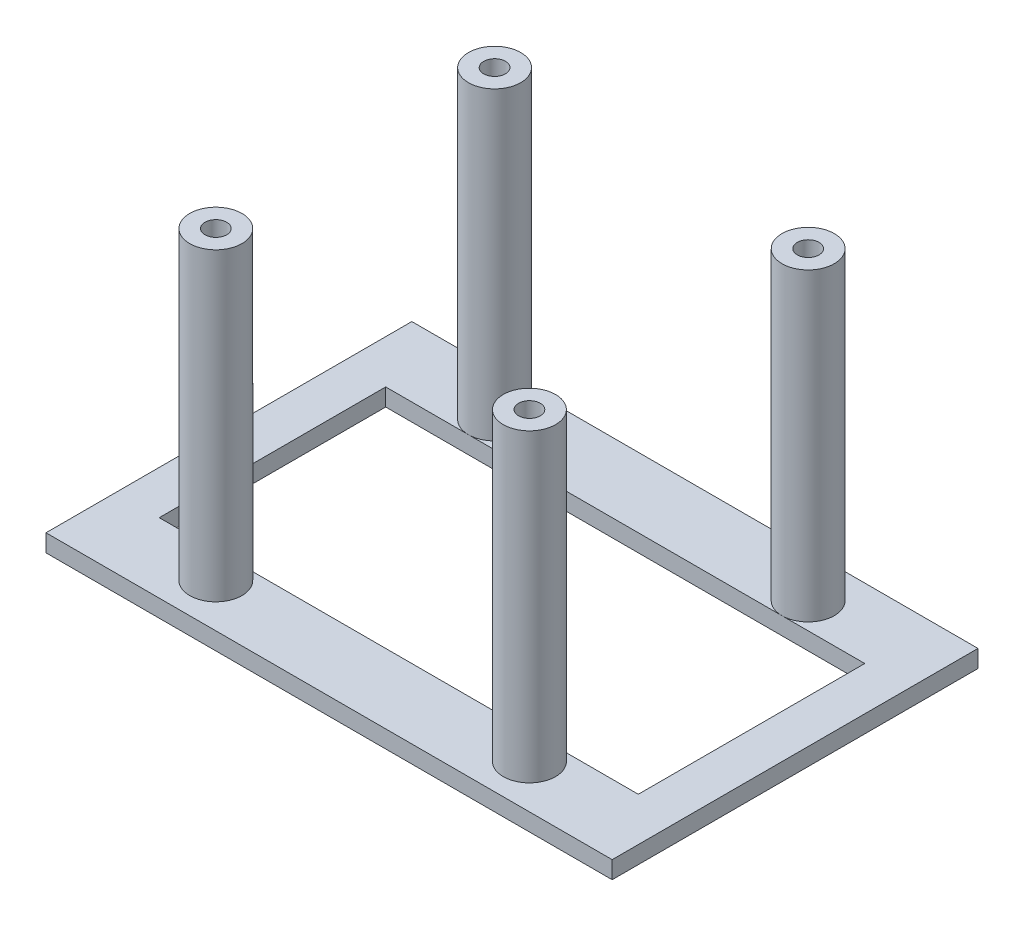
ISO-10303-21;
HEADER;
FILE_DESCRIPTION(('STEP AP214'),'2;1');
FILE_NAME('part.step','',(''),(''),'','','');
FILE_SCHEMA(('AUTOMOTIVE_DESIGN { 1 0 10303 214 1 1 1 1 }'));
ENDSEC;
DATA;
#1=APPLICATION_CONTEXT('core data for automotive mechanical design processes');
#2=APPLICATION_PROTOCOL_DEFINITION('international standard','automotive_design',2000,#1);
#3=PRODUCT_CONTEXT('',#1,'mechanical');
#4=PRODUCT('Part','Part','',(#3));
#5=PRODUCT_RELATED_PRODUCT_CATEGORY('part','',(#4));
#6=PRODUCT_DEFINITION_FORMATION('','',#4);
#7=PRODUCT_DEFINITION_CONTEXT('part definition',#1,'design');
#8=PRODUCT_DEFINITION('design','',#6,#7);
#9=PRODUCT_DEFINITION_SHAPE('','',#8);
#10=(LENGTH_UNIT() NAMED_UNIT(*) SI_UNIT(.MILLI.,.METRE.));
#11=(NAMED_UNIT(*) PLANE_ANGLE_UNIT() SI_UNIT($,.RADIAN.));
#12=(NAMED_UNIT(*) SI_UNIT($,.STERADIAN.) SOLID_ANGLE_UNIT());
#13=UNCERTAINTY_MEASURE_WITH_UNIT(LENGTH_MEASURE(1.E-05),#10,'distance_accuracy_value','');
#14=(GEOMETRIC_REPRESENTATION_CONTEXT(3) GLOBAL_UNCERTAINTY_ASSIGNED_CONTEXT((#13)) GLOBAL_UNIT_ASSIGNED_CONTEXT((#10,
#11,#12)) REPRESENTATION_CONTEXT('',''));
#15=CARTESIAN_POINT('',(0.,0.,0.));
#16=DIRECTION('',(0.,0.,1.));
#17=DIRECTION('',(1.,0.,0.));
#18=AXIS2_PLACEMENT_3D('',#15,#16,#17);
#19=CARTESIAN_POINT('',(0.,-2.,21.));
#20=DIRECTION('',(0.,0.,1.));
#21=DIRECTION('',(1.,0.,0.));
#22=AXIS2_PLACEMENT_3D('',#19,#20,#21);
#23=PLANE('',#22);
#24=DIRECTION('',(1.,0.,0.));
#25=VECTOR('',#24,1.);
#26=CARTESIAN_POINT('',(0.,0.,21.));
#27=LINE('',#26,#25);
#28=CARTESIAN_POINT('',(-32.5,0.,21.));
#29=VERTEX_POINT('',#28);
#30=CARTESIAN_POINT('',(32.5,0.,21.));
#31=VERTEX_POINT('',#30);
#32=EDGE_CURVE('E161',#29,#31,#27,.T.);
#33=ORIENTED_EDGE('',*,*,#32,.F.);
#34=DIRECTION('',(0.,1.,0.));
#35=VECTOR('',#34,1.);
#36=CARTESIAN_POINT('',(-32.5,-2.,21.));
#37=LINE('',#36,#35);
#38=CARTESIAN_POINT('',(-32.5,-2.,21.));
#39=VERTEX_POINT('',#38);
#40=EDGE_CURVE('E12',#39,#29,#37,.T.);
#41=ORIENTED_EDGE('',*,*,#40,.F.);
#42=DIRECTION('',(1.,0.,0.));
#43=VECTOR('',#42,1.);
#44=CARTESIAN_POINT('',(0.,-2.,21.));
#45=LINE('',#44,#43);
#46=CARTESIAN_POINT('',(32.5,-2.,21.));
#47=VERTEX_POINT('',#46);
#48=EDGE_CURVE('E250',#39,#47,#45,.T.);
#49=ORIENTED_EDGE('',*,*,#48,.T.);
#50=DIRECTION('',(0.,1.,0.));
#51=VECTOR('',#50,1.);
#52=CARTESIAN_POINT('',(32.5,-2.,21.));
#53=LINE('',#52,#51);
#54=EDGE_CURVE('E184',#47,#31,#53,.T.);
#55=ORIENTED_EDGE('',*,*,#54,.T.);
#56=EDGE_LOOP('',(#33,#41,#49,#55));
#57=FACE_BOUND('',#56,.T.);
#58=ADVANCED_FACE('F54',(#57),#23,.T.);
#59=CARTESIAN_POINT('',(-32.5,-2.,0.));
#60=DIRECTION('',(1.,0.,0.));
#61=DIRECTION('',(0.,0.,-1.));
#62=AXIS2_PLACEMENT_3D('',#59,#60,#61);
#63=PLANE('',#62);
#64=DIRECTION('',(0.,0.,-1.));
#65=VECTOR('',#64,1.);
#66=CARTESIAN_POINT('',(-32.5,0.,0.));
#67=LINE('',#66,#65);
#68=CARTESIAN_POINT('',(-32.5,0.,-21.));
#69=VERTEX_POINT('',#68);
#70=EDGE_CURVE('E173',#29,#69,#67,.T.);
#71=ORIENTED_EDGE('',*,*,#70,.T.);
#72=DIRECTION('',(0.,1.,0.));
#73=VECTOR('',#72,1.);
#74=CARTESIAN_POINT('',(-32.5,-2.,-21.));
#75=LINE('',#74,#73);
#76=CARTESIAN_POINT('',(-32.5,-2.,-21.));
#77=VERTEX_POINT('',#76);
#78=EDGE_CURVE('E64',#77,#69,#75,.T.);
#79=ORIENTED_EDGE('',*,*,#78,.F.);
#80=DIRECTION('',(0.,0.,-1.));
#81=VECTOR('',#80,1.);
#82=CARTESIAN_POINT('',(-32.5,-2.,0.));
#83=LINE('',#82,#81);
#84=EDGE_CURVE('E198',#39,#77,#83,.T.);
#85=ORIENTED_EDGE('',*,*,#84,.F.);
#86=ORIENTED_EDGE('',*,*,#40,.T.);
#87=EDGE_LOOP('',(#71,#79,#85,#86));
#88=FACE_BOUND('',#87,.T.);
#89=ADVANCED_FACE('F265',(#88),#63,.F.);
#90=CARTESIAN_POINT('',(0.,-2.,-21.));
#91=DIRECTION('',(0.,0.,1.));
#92=DIRECTION('',(1.,0.,0.));
#93=AXIS2_PLACEMENT_3D('',#90,#91,#92);
#94=PLANE('',#93);
#95=DIRECTION('',(1.,0.,0.));
#96=VECTOR('',#95,1.);
#97=CARTESIAN_POINT('',(0.,0.,-21.));
#98=LINE('',#97,#96);
#99=CARTESIAN_POINT('',(32.5,0.,-21.));
#100=VERTEX_POINT('',#99);
#101=EDGE_CURVE('E169',#69,#100,#98,.T.);
#102=ORIENTED_EDGE('',*,*,#101,.T.);
#103=DIRECTION('',(0.,1.,0.));
#104=VECTOR('',#103,1.);
#105=CARTESIAN_POINT('',(32.5,-2.,-21.));
#106=LINE('',#105,#104);
#107=CARTESIAN_POINT('',(32.5,-2.,-21.));
#108=VERTEX_POINT('',#107);
#109=EDGE_CURVE('E181',#108,#100,#106,.T.);
#110=ORIENTED_EDGE('',*,*,#109,.F.);
#111=DIRECTION('',(1.,0.,0.));
#112=VECTOR('',#111,1.);
#113=CARTESIAN_POINT('',(0.,-2.,-21.));
#114=LINE('',#113,#112);
#115=EDGE_CURVE('E204',#77,#108,#114,.T.);
#116=ORIENTED_EDGE('',*,*,#115,.F.);
#117=ORIENTED_EDGE('',*,*,#78,.T.);
#118=EDGE_LOOP('',(#102,#110,#116,#117));
#119=FACE_BOUND('',#118,.T.);
#120=ADVANCED_FACE('F267',(#119),#94,.F.);
#121=CARTESIAN_POINT('',(0.,-2.,13.));
#122=DIRECTION('',(0.,0.,1.));
#123=DIRECTION('',(1.,0.,0.));
#124=AXIS2_PLACEMENT_3D('',#121,#122,#123);
#125=PLANE('',#124);
#126=DIRECTION('',(1.,0.,0.));
#127=VECTOR('',#126,1.);
#128=CARTESIAN_POINT('',(0.,0.,13.));
#129=LINE('',#128,#127);
#130=CARTESIAN_POINT('',(-27.5,0.,13.));
#131=VERTEX_POINT('',#130);
#132=CARTESIAN_POINT('',(-18.,0.,13.));
#133=VERTEX_POINT('',#132);
#134=EDGE_CURVE('E214',#131,#133,#129,.T.);
#135=ORIENTED_EDGE('',*,*,#134,.T.);
#136=CARTESIAN_POINT('',(18.,0.,13.));
#137=VERTEX_POINT('',#136);
#138=EDGE_CURVE('E216',#133,#137,#129,.T.);
#139=ORIENTED_EDGE('',*,*,#138,.T.);
#140=CARTESIAN_POINT('',(27.5,0.,13.));
#141=VERTEX_POINT('',#140);
#142=EDGE_CURVE('E217',#137,#141,#129,.T.);
#143=ORIENTED_EDGE('',*,*,#142,.T.);
#144=DIRECTION('',(0.,1.,0.));
#145=VECTOR('',#144,1.);
#146=CARTESIAN_POINT('',(27.5,-2.,13.));
#147=LINE('',#146,#145);
#148=CARTESIAN_POINT('',(27.5,-2.,13.));
#149=VERTEX_POINT('',#148);
#150=EDGE_CURVE('E187',#149,#141,#147,.T.);
#151=ORIENTED_EDGE('',*,*,#150,.F.);
#152=DIRECTION('',(1.,0.,0.));
#153=VECTOR('',#152,1.);
#154=CARTESIAN_POINT('',(0.,-2.,13.));
#155=LINE('',#154,#153);
#156=CARTESIAN_POINT('',(-27.5,-2.,13.));
#157=VERTEX_POINT('',#156);
#158=EDGE_CURVE('E176',#157,#149,#155,.T.);
#159=ORIENTED_EDGE('',*,*,#158,.F.);
#160=DIRECTION('',(0.,1.,0.));
#161=VECTOR('',#160,1.);
#162=CARTESIAN_POINT('',(-27.5,-2.,13.));
#163=LINE('',#162,#161);
#164=EDGE_CURVE('E58',#157,#131,#163,.T.);
#165=ORIENTED_EDGE('',*,*,#164,.T.);
#166=EDGE_LOOP('',(#135,#139,#143,#151,#159,#165));
#167=FACE_BOUND('',#166,.T.);
#168=ADVANCED_FACE('F56',(#167),#125,.F.);
#169=CARTESIAN_POINT('',(27.5,-2.,0.));
#170=DIRECTION('',(1.,0.,0.));
#171=DIRECTION('',(0.,0.,-1.));
#172=AXIS2_PLACEMENT_3D('',#169,#170,#171);
#173=PLANE('',#172);
#174=DIRECTION('',(0.,0.,-1.));
#175=VECTOR('',#174,1.);
#176=CARTESIAN_POINT('',(27.5,0.,0.));
#177=LINE('',#176,#175);
#178=CARTESIAN_POINT('',(27.5,0.,-13.));
#179=VERTEX_POINT('',#178);
#180=EDGE_CURVE('E145',#141,#179,#177,.T.);
#181=ORIENTED_EDGE('',*,*,#180,.T.);
#182=DIRECTION('',(0.,1.,0.));
#183=VECTOR('',#182,1.);
#184=CARTESIAN_POINT('',(27.5,-2.,-13.));
#185=LINE('',#184,#183);
#186=CARTESIAN_POINT('',(27.5,-2.,-13.));
#187=VERTEX_POINT('',#186);
#188=EDGE_CURVE('E191',#187,#179,#185,.T.);
#189=ORIENTED_EDGE('',*,*,#188,.F.);
#190=DIRECTION('',(0.,0.,-1.));
#191=VECTOR('',#190,1.);
#192=CARTESIAN_POINT('',(27.5,-2.,0.));
#193=LINE('',#192,#191);
#194=EDGE_CURVE('E247',#149,#187,#193,.T.);
#195=ORIENTED_EDGE('',*,*,#194,.F.);
#196=ORIENTED_EDGE('',*,*,#150,.T.);
#197=EDGE_LOOP('',(#181,#189,#195,#196));
#198=FACE_BOUND('',#197,.T.);
#199=ADVANCED_FACE('F290',(#198),#173,.F.);
#200=CARTESIAN_POINT('',(0.,-2.,-13.));
#201=DIRECTION('',(0.,0.,1.));
#202=DIRECTION('',(1.,0.,0.));
#203=AXIS2_PLACEMENT_3D('',#200,#201,#202);
#204=PLANE('',#203);
#205=DIRECTION('',(1.,0.,0.));
#206=VECTOR('',#205,1.);
#207=CARTESIAN_POINT('',(0.,0.,-13.));
#208=LINE('',#207,#206);
#209=CARTESIAN_POINT('',(-27.5,0.,-13.));
#210=VERTEX_POINT('',#209);
#211=CARTESIAN_POINT('',(-18.,0.,-13.));
#212=VERTEX_POINT('',#211);
#213=EDGE_CURVE('E132',#210,#212,#208,.T.);
#214=ORIENTED_EDGE('',*,*,#213,.F.);
#215=DIRECTION('',(0.,1.,0.));
#216=VECTOR('',#215,1.);
#217=CARTESIAN_POINT('',(-27.5,-2.,-13.));
#218=LINE('',#217,#216);
#219=CARTESIAN_POINT('',(-27.5,-2.,-13.));
#220=VERTEX_POINT('',#219);
#221=EDGE_CURVE('E193',#220,#210,#218,.T.);
#222=ORIENTED_EDGE('',*,*,#221,.F.);
#223=DIRECTION('',(1.,0.,0.));
#224=VECTOR('',#223,1.);
#225=CARTESIAN_POINT('',(0.,-2.,-13.));
#226=LINE('',#225,#224);
#227=EDGE_CURVE('E243',#220,#187,#226,.T.);
#228=ORIENTED_EDGE('',*,*,#227,.T.);
#229=ORIENTED_EDGE('',*,*,#188,.T.);
#230=CARTESIAN_POINT('',(18.,0.,-13.));
#231=VERTEX_POINT('',#230);
#232=EDGE_CURVE('E148',#231,#179,#208,.T.);
#233=ORIENTED_EDGE('',*,*,#232,.F.);
#234=EDGE_CURVE('E146',#212,#231,#208,.T.);
#235=ORIENTED_EDGE('',*,*,#234,.F.);
#236=EDGE_LOOP('',(#214,#222,#228,#229,#233,#235));
#237=FACE_BOUND('',#236,.T.);
#238=ADVANCED_FACE('F150',(#237),#204,.T.);
#239=CARTESIAN_POINT('',(32.5,-2.,0.));
#240=DIRECTION('',(1.,0.,0.));
#241=DIRECTION('',(0.,0.,-1.));
#242=AXIS2_PLACEMENT_3D('',#239,#240,#241);
#243=PLANE('',#242);
#244=DIRECTION('',(0.,0.,-1.));
#245=VECTOR('',#244,1.);
#246=CARTESIAN_POINT('',(32.5,0.,0.));
#247=LINE('',#246,#245);
#248=EDGE_CURVE('E165',#31,#100,#247,.T.);
#249=ORIENTED_EDGE('',*,*,#248,.F.);
#250=ORIENTED_EDGE('',*,*,#54,.F.);
#251=DIRECTION('',(0.,0.,-1.));
#252=VECTOR('',#251,1.);
#253=CARTESIAN_POINT('',(32.5,-2.,0.));
#254=LINE('',#253,#252);
#255=EDGE_CURVE('E211',#47,#108,#254,.T.);
#256=ORIENTED_EDGE('',*,*,#255,.T.);
#257=ORIENTED_EDGE('',*,*,#109,.T.);
#258=EDGE_LOOP('',(#249,#250,#256,#257));
#259=FACE_BOUND('',#258,.T.);
#260=ADVANCED_FACE('F258',(#259),#243,.T.);
#261=CARTESIAN_POINT('',(-27.5,-2.,0.));
#262=DIRECTION('',(1.,0.,0.));
#263=DIRECTION('',(0.,0.,-1.));
#264=AXIS2_PLACEMENT_3D('',#261,#262,#263);
#265=PLANE('',#264);
#266=DIRECTION('',(0.,0.,-1.));
#267=VECTOR('',#266,1.);
#268=CARTESIAN_POINT('',(-27.5,0.,0.));
#269=LINE('',#268,#267);
#270=EDGE_CURVE('E142',#131,#210,#269,.T.);
#271=ORIENTED_EDGE('',*,*,#270,.F.);
#272=ORIENTED_EDGE('',*,*,#164,.F.);
#273=DIRECTION('',(0.,0.,-1.));
#274=VECTOR('',#273,1.);
#275=CARTESIAN_POINT('',(-27.5,-2.,0.));
#276=LINE('',#275,#274);
#277=EDGE_CURVE('E240',#157,#220,#276,.T.);
#278=ORIENTED_EDGE('',*,*,#277,.T.);
#279=ORIENTED_EDGE('',*,*,#221,.T.);
#280=EDGE_LOOP('',(#271,#272,#278,#279));
#281=FACE_BOUND('',#280,.T.);
#282=ADVANCED_FACE('F278',(#281),#265,.T.);
#283=CARTESIAN_POINT('',(0.,-2.,0.));
#284=DIRECTION('',(0.,1.,0.));
#285=DIRECTION('',(0.,0.,1.));
#286=AXIS2_PLACEMENT_3D('',#283,#284,#285);
#287=PLANE('',#286);
#288=ORIENTED_EDGE('',*,*,#158,.T.);
#289=ORIENTED_EDGE('',*,*,#194,.T.);
#290=ORIENTED_EDGE('',*,*,#227,.F.);
#291=ORIENTED_EDGE('',*,*,#277,.F.);
#292=EDGE_LOOP('',(#288,#289,#290,#291));
#293=FACE_BOUND('',#292,.T.);
#294=ORIENTED_EDGE('',*,*,#48,.F.);
#295=ORIENTED_EDGE('',*,*,#84,.T.);
#296=ORIENTED_EDGE('',*,*,#115,.T.);
#297=ORIENTED_EDGE('',*,*,#255,.F.);
#298=EDGE_LOOP('',(#294,#295,#296,#297));
#299=FACE_BOUND('',#298,.T.);
#300=ADVANCED_FACE('F260',(#293,#299),#287,.F.);
#301=CARTESIAN_POINT('',(0.,0.,0.));
#302=DIRECTION('',(0.,1.,0.));
#303=DIRECTION('',(0.,0.,1.));
#304=AXIS2_PLACEMENT_3D('',#301,#302,#303);
#305=PLANE('',#304);
#306=ORIENTED_EDGE('',*,*,#142,.F.);
#307=CARTESIAN_POINT('',(18.,0.,16.));
#308=DIRECTION('',(0.,1.,0.));
#309=DIRECTION('',(0.,0.,1.));
#310=AXIS2_PLACEMENT_3D('',#307,#308,#309);
#311=CIRCLE('',#310,3.);
#312=EDGE_CURVE('E70',#137,#137,#311,.T.);
#313=ORIENTED_EDGE('',*,*,#312,.F.);
#314=ORIENTED_EDGE('',*,*,#138,.F.);
#315=CARTESIAN_POINT('',(-18.,0.,16.));
#316=DIRECTION('',(0.,1.,0.));
#317=DIRECTION('',(0.,0.,1.));
#318=AXIS2_PLACEMENT_3D('',#315,#316,#317);
#319=CIRCLE('',#318,3.);
#320=EDGE_CURVE('E75',#133,#133,#319,.T.);
#321=ORIENTED_EDGE('',*,*,#320,.F.);
#322=ORIENTED_EDGE('',*,*,#134,.F.);
#323=ORIENTED_EDGE('',*,*,#270,.T.);
#324=ORIENTED_EDGE('',*,*,#213,.T.);
#325=CARTESIAN_POINT('',(-18.,0.,-16.));
#326=DIRECTION('',(0.,1.,0.));
#327=DIRECTION('',(0.,0.,1.));
#328=AXIS2_PLACEMENT_3D('',#325,#326,#327);
#329=CIRCLE('',#328,3.);
#330=EDGE_CURVE('E139',#212,#212,#329,.T.);
#331=ORIENTED_EDGE('',*,*,#330,.F.);
#332=ORIENTED_EDGE('',*,*,#234,.T.);
#333=CARTESIAN_POINT('',(18.,0.,-16.));
#334=DIRECTION('',(0.,1.,0.));
#335=DIRECTION('',(0.,0.,1.));
#336=AXIS2_PLACEMENT_3D('',#333,#334,#335);
#337=CIRCLE('',#336,3.);
#338=EDGE_CURVE('E234',#231,#231,#337,.T.);
#339=ORIENTED_EDGE('',*,*,#338,.F.);
#340=ORIENTED_EDGE('',*,*,#232,.T.);
#341=ORIENTED_EDGE('',*,*,#180,.F.);
#342=EDGE_LOOP('',(#306,#313,#314,#321,#322,#323,#324,#331,#332,#339,#340,#341));
#343=FACE_BOUND('',#342,.T.);
#344=ORIENTED_EDGE('',*,*,#32,.T.);
#345=ORIENTED_EDGE('',*,*,#248,.T.);
#346=ORIENTED_EDGE('',*,*,#101,.F.);
#347=ORIENTED_EDGE('',*,*,#70,.F.);
#348=EDGE_LOOP('',(#344,#345,#346,#347));
#349=FACE_BOUND('',#348,.T.);
#350=ADVANCED_FACE('F135',(#343,#349),#305,.T.);
#351=CARTESIAN_POINT('',(-18.,35.,-16.));
#352=DIRECTION('',(0.,-1.,0.));
#353=DIRECTION('',(0.,0.,-1.));
#354=AXIS2_PLACEMENT_3D('',#351,#352,#353);
#355=CYLINDRICAL_SURFACE('',#354,3.);
#356=CARTESIAN_POINT('',(-18.,35.,-16.));
#357=DIRECTION('',(0.,1.,0.));
#358=DIRECTION('',(0.,0.,1.));
#359=AXIS2_PLACEMENT_3D('',#356,#357,#358);
#360=CIRCLE('',#359,3.);
#361=CARTESIAN_POINT('',(-18.,35.,-13.));
#362=VERTEX_POINT('',#361);
#363=EDGE_CURVE('E222',#362,#362,#360,.T.);
#364=ORIENTED_EDGE('',*,*,#363,.F.);
#365=EDGE_LOOP('',(#364));
#366=FACE_BOUND('',#365,.T.);
#367=ORIENTED_EDGE('',*,*,#330,.T.);
#368=EDGE_LOOP('',(#367));
#369=FACE_BOUND('',#368,.T.);
#370=ADVANCED_FACE('F269',(#366,#369),#355,.T.);
#371=CARTESIAN_POINT('',(0.,35.,0.));
#372=DIRECTION('',(0.,1.,0.));
#373=DIRECTION('',(0.,0.,1.));
#374=AXIS2_PLACEMENT_3D('',#371,#372,#373);
#375=PLANE('',#374);
#376=CARTESIAN_POINT('',(-18.,35.,-16.));
#377=DIRECTION('',(0.,1.,0.));
#378=DIRECTION('',(0.,0.,1.));
#379=AXIS2_PLACEMENT_3D('',#376,#377,#378);
#380=CIRCLE('',#379,1.25);
#381=CARTESIAN_POINT('',(-18.,35.,-14.75));
#382=VERTEX_POINT('',#381);
#383=EDGE_CURVE('E322',#382,#382,#380,.T.);
#384=ORIENTED_EDGE('',*,*,#383,.F.);
#385=EDGE_LOOP('',(#384));
#386=FACE_BOUND('',#385,.T.);
#387=ORIENTED_EDGE('',*,*,#363,.T.);
#388=EDGE_LOOP('',(#387));
#389=FACE_BOUND('',#388,.T.);
#390=ADVANCED_FACE('F275',(#386,#389),#375,.T.);
#391=CARTESIAN_POINT('',(18.,35.,-16.));
#392=DIRECTION('',(0.,-1.,0.));
#393=DIRECTION('',(0.,0.,-1.));
#394=AXIS2_PLACEMENT_3D('',#391,#392,#393);
#395=CYLINDRICAL_SURFACE('',#394,3.);
#396=CARTESIAN_POINT('',(18.,35.,-16.));
#397=DIRECTION('',(0.,1.,0.));
#398=DIRECTION('',(0.,0.,1.));
#399=AXIS2_PLACEMENT_3D('',#396,#397,#398);
#400=CIRCLE('',#399,3.);
#401=CARTESIAN_POINT('',(18.,35.,-13.));
#402=VERTEX_POINT('',#401);
#403=EDGE_CURVE('E231',#402,#402,#400,.T.);
#404=ORIENTED_EDGE('',*,*,#403,.F.);
#405=EDGE_LOOP('',(#404));
#406=FACE_BOUND('',#405,.T.);
#407=ORIENTED_EDGE('',*,*,#338,.T.);
#408=EDGE_LOOP('',(#407));
#409=FACE_BOUND('',#408,.T.);
#410=ADVANCED_FACE('F360',(#406,#409),#395,.T.);
#411=CARTESIAN_POINT('',(0.,35.,0.));
#412=DIRECTION('',(0.,1.,0.));
#413=DIRECTION('',(0.,0.,1.));
#414=AXIS2_PLACEMENT_3D('',#411,#412,#413);
#415=PLANE('',#414);
#416=CARTESIAN_POINT('',(18.,35.,-16.));
#417=DIRECTION('',(0.,1.,0.));
#418=DIRECTION('',(0.,0.,1.));
#419=AXIS2_PLACEMENT_3D('',#416,#417,#418);
#420=CIRCLE('',#419,1.25);
#421=CARTESIAN_POINT('',(18.,35.,-14.75));
#422=VERTEX_POINT('',#421);
#423=EDGE_CURVE('E326',#422,#422,#420,.T.);
#424=ORIENTED_EDGE('',*,*,#423,.F.);
#425=EDGE_LOOP('',(#424));
#426=FACE_BOUND('',#425,.T.);
#427=ORIENTED_EDGE('',*,*,#403,.T.);
#428=EDGE_LOOP('',(#427));
#429=FACE_BOUND('',#428,.T.);
#430=ADVANCED_FACE('F356',(#426,#429),#415,.T.);
#431=CARTESIAN_POINT('',(-18.,35.,16.));
#432=DIRECTION('',(0.,-1.,0.));
#433=DIRECTION('',(0.,0.,-1.));
#434=AXIS2_PLACEMENT_3D('',#431,#432,#433);
#435=CYLINDRICAL_SURFACE('',#434,3.);
#436=CARTESIAN_POINT('',(-18.,35.,16.));
#437=DIRECTION('',(0.,1.,0.));
#438=DIRECTION('',(0.,0.,1.));
#439=AXIS2_PLACEMENT_3D('',#436,#437,#438);
#440=CIRCLE('',#439,3.);
#441=CARTESIAN_POINT('',(-18.,35.,19.));
#442=VERTEX_POINT('',#441);
#443=EDGE_CURVE('E304',#442,#442,#440,.T.);
#444=ORIENTED_EDGE('',*,*,#443,.F.);
#445=EDGE_LOOP('',(#444));
#446=FACE_BOUND('',#445,.T.);
#447=ORIENTED_EDGE('',*,*,#320,.T.);
#448=EDGE_LOOP('',(#447));
#449=FACE_BOUND('',#448,.T.);
#450=ADVANCED_FACE('F359',(#446,#449),#435,.T.);
#451=CARTESIAN_POINT('',(0.,35.,0.));
#452=DIRECTION('',(0.,1.,0.));
#453=DIRECTION('',(0.,0.,1.));
#454=AXIS2_PLACEMENT_3D('',#451,#452,#453);
#455=PLANE('',#454);
#456=CARTESIAN_POINT('',(-18.,35.,16.));
#457=DIRECTION('',(0.,1.,0.));
#458=DIRECTION('',(0.,0.,1.));
#459=AXIS2_PLACEMENT_3D('',#456,#457,#458);
#460=CIRCLE('',#459,1.25);
#461=CARTESIAN_POINT('',(-18.,35.,17.25));
#462=VERTEX_POINT('',#461);
#463=EDGE_CURVE('E334',#462,#462,#460,.T.);
#464=ORIENTED_EDGE('',*,*,#463,.F.);
#465=EDGE_LOOP('',(#464));
#466=FACE_BOUND('',#465,.T.);
#467=ORIENTED_EDGE('',*,*,#443,.T.);
#468=EDGE_LOOP('',(#467));
#469=FACE_BOUND('',#468,.T.);
#470=ADVANCED_FACE('F374',(#466,#469),#455,.T.);
#471=CARTESIAN_POINT('',(18.,35.,16.));
#472=DIRECTION('',(0.,-1.,0.));
#473=DIRECTION('',(0.,0.,-1.));
#474=AXIS2_PLACEMENT_3D('',#471,#472,#473);
#475=CYLINDRICAL_SURFACE('',#474,3.);
#476=CARTESIAN_POINT('',(18.,35.,16.));
#477=DIRECTION('',(0.,1.,0.));
#478=DIRECTION('',(0.,0.,1.));
#479=AXIS2_PLACEMENT_3D('',#476,#477,#478);
#480=CIRCLE('',#479,3.);
#481=CARTESIAN_POINT('',(18.,35.,19.));
#482=VERTEX_POINT('',#481);
#483=EDGE_CURVE('E313',#482,#482,#480,.T.);
#484=ORIENTED_EDGE('',*,*,#483,.F.);
#485=EDGE_LOOP('',(#484));
#486=FACE_BOUND('',#485,.T.);
#487=ORIENTED_EDGE('',*,*,#312,.T.);
#488=EDGE_LOOP('',(#487));
#489=FACE_BOUND('',#488,.T.);
#490=ADVANCED_FACE('F378',(#486,#489),#475,.T.);
#491=CARTESIAN_POINT('',(0.,35.,0.));
#492=DIRECTION('',(0.,1.,0.));
#493=DIRECTION('',(0.,0.,1.));
#494=AXIS2_PLACEMENT_3D('',#491,#492,#493);
#495=PLANE('',#494);
#496=CARTESIAN_POINT('',(18.,35.,16.));
#497=DIRECTION('',(0.,1.,0.));
#498=DIRECTION('',(0.,0.,1.));
#499=AXIS2_PLACEMENT_3D('',#496,#497,#498);
#500=CIRCLE('',#499,1.25);
#501=CARTESIAN_POINT('',(18.,35.,17.25));
#502=VERTEX_POINT('',#501);
#503=EDGE_CURVE('E342',#502,#502,#500,.T.);
#504=ORIENTED_EDGE('',*,*,#503,.F.);
#505=EDGE_LOOP('',(#504));
#506=FACE_BOUND('',#505,.T.);
#507=ORIENTED_EDGE('',*,*,#483,.T.);
#508=EDGE_LOOP('',(#507));
#509=FACE_BOUND('',#508,.T.);
#510=ADVANCED_FACE('F382',(#506,#509),#495,.T.);
#511=CARTESIAN_POINT('',(18.,24.,16.));
#512=DIRECTION('',(0.,1.,0.));
#513=DIRECTION('',(0.,0.,1.));
#514=AXIS2_PLACEMENT_3D('',#511,#512,#513);
#515=CYLINDRICAL_SURFACE('',#514,1.25);
#516=CARTESIAN_POINT('',(18.,24.,16.));
#517=DIRECTION('',(0.,1.,0.));
#518=DIRECTION('',(0.,0.,1.));
#519=AXIS2_PLACEMENT_3D('',#516,#517,#518);
#520=CIRCLE('',#519,1.25);
#521=CARTESIAN_POINT('',(18.,24.,17.25));
#522=VERTEX_POINT('',#521);
#523=EDGE_CURVE('E338',#522,#522,#520,.T.);
#524=ORIENTED_EDGE('',*,*,#523,.F.);
#525=EDGE_LOOP('',(#524));
#526=FACE_BOUND('',#525,.T.);
#527=ORIENTED_EDGE('',*,*,#503,.T.);
#528=EDGE_LOOP('',(#527));
#529=FACE_BOUND('',#528,.T.);
#530=ADVANCED_FACE('F386',(#526,#529),#515,.F.);
#531=CARTESIAN_POINT('',(18.,24.,16.));
#532=DIRECTION('',(0.,1.,0.));
#533=DIRECTION('',(0.,0.,1.));
#534=AXIS2_PLACEMENT_3D('',#531,#532,#533);
#535=PLANE('',#534);
#536=ORIENTED_EDGE('',*,*,#523,.T.);
#537=EDGE_LOOP('',(#536));
#538=FACE_BOUND('',#537,.T.);
#539=ADVANCED_FACE('F404',(#538),#535,.T.);
#540=CARTESIAN_POINT('',(-18.,24.,16.));
#541=DIRECTION('',(0.,1.,0.));
#542=DIRECTION('',(0.,0.,1.));
#543=AXIS2_PLACEMENT_3D('',#540,#541,#542);
#544=CYLINDRICAL_SURFACE('',#543,1.25);
#545=CARTESIAN_POINT('',(-18.,24.,16.));
#546=DIRECTION('',(0.,1.,0.));
#547=DIRECTION('',(0.,0.,1.));
#548=AXIS2_PLACEMENT_3D('',#545,#546,#547);
#549=CIRCLE('',#548,1.25);
#550=CARTESIAN_POINT('',(-18.,24.,17.25));
#551=VERTEX_POINT('',#550);
#552=EDGE_CURVE('E330',#551,#551,#549,.T.);
#553=ORIENTED_EDGE('',*,*,#552,.F.);
#554=EDGE_LOOP('',(#553));
#555=FACE_BOUND('',#554,.T.);
#556=ORIENTED_EDGE('',*,*,#463,.T.);
#557=EDGE_LOOP('',(#556));
#558=FACE_BOUND('',#557,.T.);
#559=ADVANCED_FACE('F400',(#555,#558),#544,.F.);
#560=CARTESIAN_POINT('',(-18.,24.,16.));
#561=DIRECTION('',(0.,1.,0.));
#562=DIRECTION('',(0.,0.,1.));
#563=AXIS2_PLACEMENT_3D('',#560,#561,#562);
#564=PLANE('',#563);
#565=ORIENTED_EDGE('',*,*,#552,.T.);
#566=EDGE_LOOP('',(#565));
#567=FACE_BOUND('',#566,.T.);
#568=ADVANCED_FACE('F397',(#567),#564,.T.);
#569=CARTESIAN_POINT('',(18.,24.,-16.));
#570=DIRECTION('',(0.,1.,0.));
#571=DIRECTION('',(0.,0.,1.));
#572=AXIS2_PLACEMENT_3D('',#569,#570,#571);
#573=CYLINDRICAL_SURFACE('',#572,1.25);
#574=CARTESIAN_POINT('',(18.,24.,-16.));
#575=DIRECTION('',(0.,1.,0.));
#576=DIRECTION('',(0.,0.,1.));
#577=AXIS2_PLACEMENT_3D('',#574,#575,#576);
#578=CIRCLE('',#577,1.25);
#579=CARTESIAN_POINT('',(18.,24.,-14.75));
#580=VERTEX_POINT('',#579);
#581=EDGE_CURVE('E346',#580,#580,#578,.T.);
#582=ORIENTED_EDGE('',*,*,#581,.F.);
#583=EDGE_LOOP('',(#582));
#584=FACE_BOUND('',#583,.T.);
#585=ORIENTED_EDGE('',*,*,#423,.T.);
#586=EDGE_LOOP('',(#585));
#587=FACE_BOUND('',#586,.T.);
#588=ADVANCED_FACE('F354',(#584,#587),#573,.F.);
#589=CARTESIAN_POINT('',(18.,24.,-16.));
#590=DIRECTION('',(0.,1.,0.));
#591=DIRECTION('',(0.,0.,1.));
#592=AXIS2_PLACEMENT_3D('',#589,#590,#591);
#593=PLANE('',#592);
#594=ORIENTED_EDGE('',*,*,#581,.T.);
#595=EDGE_LOOP('',(#594));
#596=FACE_BOUND('',#595,.T.);
#597=ADVANCED_FACE('F392',(#596),#593,.T.);
#598=CARTESIAN_POINT('',(-18.,24.,-16.));
#599=DIRECTION('',(0.,1.,0.));
#600=DIRECTION('',(0.,0.,1.));
#601=AXIS2_PLACEMENT_3D('',#598,#599,#600);
#602=CYLINDRICAL_SURFACE('',#601,1.25);
#603=CARTESIAN_POINT('',(-18.,24.,-16.));
#604=DIRECTION('',(0.,1.,0.));
#605=DIRECTION('',(0.,0.,1.));
#606=AXIS2_PLACEMENT_3D('',#603,#604,#605);
#607=CIRCLE('',#606,1.25);
#608=CARTESIAN_POINT('',(-18.,24.,-14.75));
#609=VERTEX_POINT('',#608);
#610=EDGE_CURVE('E318',#609,#609,#607,.T.);
#611=ORIENTED_EDGE('',*,*,#610,.F.);
#612=EDGE_LOOP('',(#611));
#613=FACE_BOUND('',#612,.T.);
#614=ORIENTED_EDGE('',*,*,#383,.T.);
#615=EDGE_LOOP('',(#614));
#616=FACE_BOUND('',#615,.T.);
#617=ADVANCED_FACE('F388',(#613,#616),#602,.F.);
#618=CARTESIAN_POINT('',(-18.,24.,-16.));
#619=DIRECTION('',(0.,1.,0.));
#620=DIRECTION('',(0.,0.,1.));
#621=AXIS2_PLACEMENT_3D('',#618,#619,#620);
#622=PLANE('',#621);
#623=ORIENTED_EDGE('',*,*,#610,.T.);
#624=EDGE_LOOP('',(#623));
#625=FACE_BOUND('',#624,.T.);
#626=ADVANCED_FACE('F391',(#625),#622,.T.);
#627=CLOSED_SHELL('',(#58,#89,#120,#168,#199,#238,#260,#282,#300,#350,#370,#390,#410,#430,#450,
#470,#490,#510,#530,#539,#559,#568,#588,#597,#617,#626));
#628=MANIFOLD_SOLID_BREP('B2',#627);
#629=ADVANCED_BREP_SHAPE_REPRESENTATION('',(#18,#628),#14);
#630=SHAPE_DEFINITION_REPRESENTATION(#9,#629);
ENDSEC;
END-ISO-10303-21;
